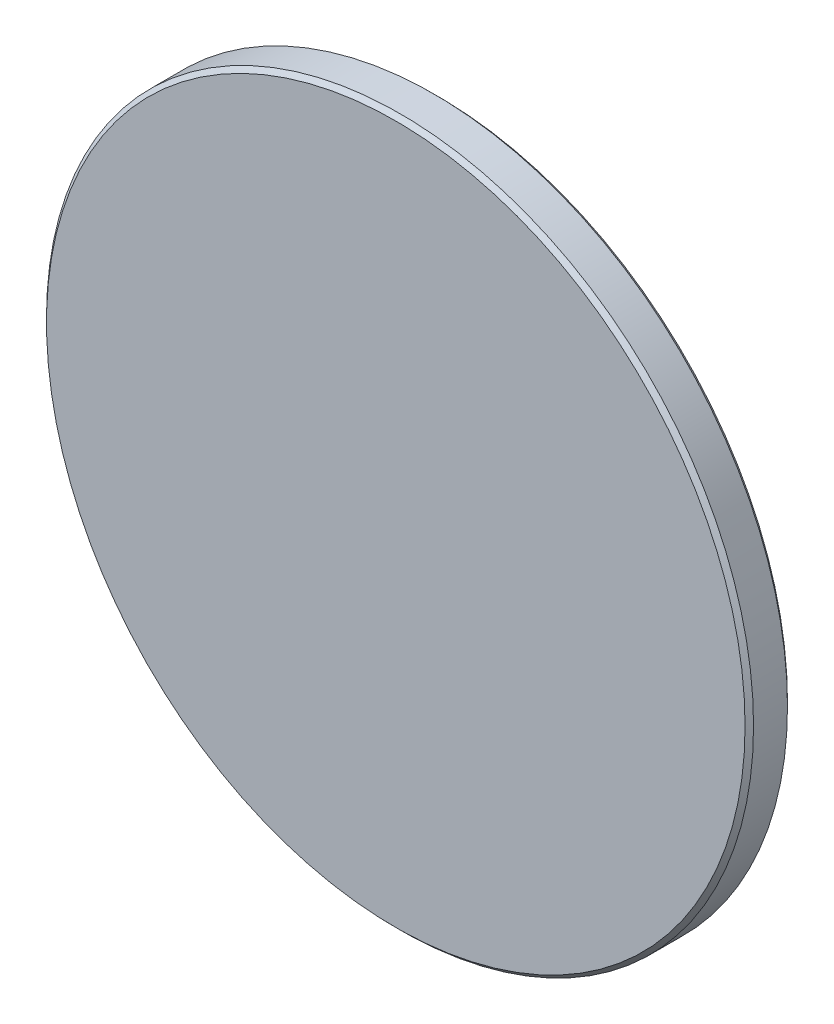
ISO-10303-21;
HEADER;
FILE_DESCRIPTION(('STEP AP214'),'2;1');
FILE_NAME('part.step','',(''),(''),'','','');
FILE_SCHEMA(('AUTOMOTIVE_DESIGN { 1 0 10303 214 1 1 1 1 }'));
ENDSEC;
DATA;
#1=APPLICATION_CONTEXT('core data for automotive mechanical design processes');
#2=APPLICATION_PROTOCOL_DEFINITION('international standard','automotive_design',2000,#1);
#3=PRODUCT_CONTEXT('',#1,'mechanical');
#4=PRODUCT('Part','Part','',(#3));
#5=PRODUCT_RELATED_PRODUCT_CATEGORY('part','',(#4));
#6=PRODUCT_DEFINITION_FORMATION('','',#4);
#7=PRODUCT_DEFINITION_CONTEXT('part definition',#1,'design');
#8=PRODUCT_DEFINITION('design','',#6,#7);
#9=PRODUCT_DEFINITION_SHAPE('','',#8);
#10=(LENGTH_UNIT() NAMED_UNIT(*) SI_UNIT(.MILLI.,.METRE.));
#11=(NAMED_UNIT(*) PLANE_ANGLE_UNIT() SI_UNIT($,.RADIAN.));
#12=(NAMED_UNIT(*) SI_UNIT($,.STERADIAN.) SOLID_ANGLE_UNIT());
#13=UNCERTAINTY_MEASURE_WITH_UNIT(LENGTH_MEASURE(1.E-05),#10,'distance_accuracy_value','');
#14=(GEOMETRIC_REPRESENTATION_CONTEXT(3) GLOBAL_UNCERTAINTY_ASSIGNED_CONTEXT((#13)) GLOBAL_UNIT_ASSIGNED_CONTEXT((#10,
#11,#12)) REPRESENTATION_CONTEXT('',''));
#15=CARTESIAN_POINT('',(0.,0.,0.));
#16=DIRECTION('',(0.,0.,1.));
#17=DIRECTION('',(1.,0.,0.));
#18=AXIS2_PLACEMENT_3D('',#15,#16,#17);
#19=CARTESIAN_POINT('',(0.,0.,3.));
#20=DIRECTION('',(0.,0.,-1.));
#21=DIRECTION('',(-1.,0.,0.));
#22=AXIS2_PLACEMENT_3D('',#19,#20,#21);
#23=CYLINDRICAL_SURFACE('',#22,25.);
#24=CARTESIAN_POINT('',(0.,0.,0.300000000000005));
#25=DIRECTION('',(0.,0.,1.));
#26=DIRECTION('',(1.,0.,0.));
#27=AXIS2_PLACEMENT_3D('',#24,#25,#26);
#28=CIRCLE('',#27,25.);
#29=CARTESIAN_POINT('',(25.,0.,0.300000000000005));
#30=VERTEX_POINT('',#29);
#31=EDGE_CURVE('E44',#30,#30,#28,.T.);
#32=ORIENTED_EDGE('',*,*,#31,.T.);
#33=EDGE_LOOP('',(#32));
#34=FACE_BOUND('',#33,.T.);
#35=CARTESIAN_POINT('',(0.,0.,2.70000000000001));
#36=DIRECTION('',(0.,0.,1.));
#37=DIRECTION('',(1.,0.,0.));
#38=AXIS2_PLACEMENT_3D('',#35,#36,#37);
#39=CIRCLE('',#38,25.);
#40=CARTESIAN_POINT('',(25.,0.,2.70000000000001));
#41=VERTEX_POINT('',#40);
#42=EDGE_CURVE('E48',#41,#41,#39,.F.);
#43=ORIENTED_EDGE('',*,*,#42,.T.);
#44=EDGE_LOOP('',(#43));
#45=FACE_BOUND('',#44,.T.);
#46=ADVANCED_FACE('F33',(#34,#45),#23,.T.);
#47=CARTESIAN_POINT('',(0.,0.,3.));
#48=DIRECTION('',(0.,0.,1.));
#49=DIRECTION('',(1.,0.,0.));
#50=AXIS2_PLACEMENT_3D('',#47,#48,#49);
#51=PLANE('',#50);
#52=CARTESIAN_POINT('',(0.,0.,3.));
#53=DIRECTION('',(0.,0.,1.));
#54=DIRECTION('',(1.,0.,0.));
#55=AXIS2_PLACEMENT_3D('',#52,#53,#54);
#56=CIRCLE('',#55,24.7);
#57=CARTESIAN_POINT('',(24.7,0.,3.));
#58=VERTEX_POINT('',#57);
#59=EDGE_CURVE('E10',#58,#58,#56,.T.);
#60=ORIENTED_EDGE('',*,*,#59,.T.);
#61=EDGE_LOOP('',(#60));
#62=FACE_BOUND('',#61,.T.);
#63=ADVANCED_FACE('F64',(#62),#51,.T.);
#64=CARTESIAN_POINT('',(0.,0.,0.));
#65=DIRECTION('',(0.,0.,1.));
#66=DIRECTION('',(1.,0.,0.));
#67=AXIS2_PLACEMENT_3D('',#64,#65,#66);
#68=PLANE('',#67);
#69=CARTESIAN_POINT('',(0.,0.,0.));
#70=DIRECTION('',(0.,0.,1.));
#71=DIRECTION('',(1.,0.,0.));
#72=AXIS2_PLACEMENT_3D('',#69,#70,#71);
#73=CIRCLE('',#72,24.7);
#74=CARTESIAN_POINT('',(24.7,0.,0.));
#75=VERTEX_POINT('',#74);
#76=EDGE_CURVE('E40',#75,#75,#73,.F.);
#77=ORIENTED_EDGE('',*,*,#76,.T.);
#78=EDGE_LOOP('',(#77));
#79=FACE_BOUND('',#78,.T.);
#80=ADVANCED_FACE('F61',(#79),#68,.F.);
#81=CARTESIAN_POINT('',(0.,0.,0.300000000000005));
#82=DIRECTION('',(0.,0.,1.));
#83=DIRECTION('',(1.,0.,0.));
#84=AXIS2_PLACEMENT_3D('',#81,#82,#83);
#85=CONICAL_SURFACE('',#84,25.,0.785398163397448);
#86=ORIENTED_EDGE('',*,*,#76,.F.);
#87=EDGE_LOOP('',(#86));
#88=FACE_BOUND('',#87,.T.);
#89=ORIENTED_EDGE('',*,*,#31,.F.);
#90=EDGE_LOOP('',(#89));
#91=FACE_BOUND('',#90,.T.);
#92=ADVANCED_FACE('F57',(#88,#91),#85,.T.);
#93=CARTESIAN_POINT('',(0.,0.,3.));
#94=DIRECTION('',(0.,0.,-1.));
#95=DIRECTION('',(-1.,0.,0.));
#96=AXIS2_PLACEMENT_3D('',#93,#94,#95);
#97=CONICAL_SURFACE('',#96,24.7,0.785398163397443);
#98=ORIENTED_EDGE('',*,*,#42,.F.);
#99=EDGE_LOOP('',(#98));
#100=FACE_BOUND('',#99,.T.);
#101=ORIENTED_EDGE('',*,*,#59,.F.);
#102=EDGE_LOOP('',(#101));
#103=FACE_BOUND('',#102,.T.);
#104=ADVANCED_FACE('F35',(#100,#103),#97,.T.);
#105=CLOSED_SHELL('',(#46,#63,#80,#92,#104));
#106=MANIFOLD_SOLID_BREP('B2',#105);
#107=ADVANCED_BREP_SHAPE_REPRESENTATION('',(#18,#106),#14);
#108=SHAPE_DEFINITION_REPRESENTATION(#9,#107);
ENDSEC;
END-ISO-10303-21;
